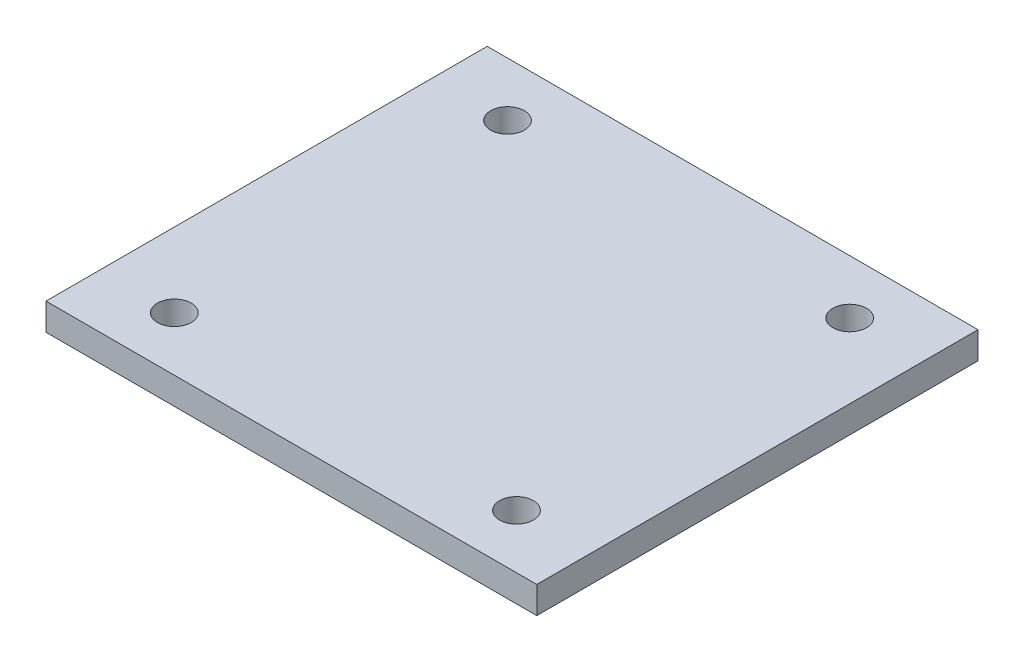
ISO-10303-21;
HEADER;
FILE_DESCRIPTION(('STEP AP214'),'2;1');
FILE_NAME('part.step','',(''),(''),'','','');
FILE_SCHEMA(('AUTOMOTIVE_DESIGN { 1 0 10303 214 1 1 1 1 }'));
ENDSEC;
DATA;
#1=APPLICATION_CONTEXT('core data for automotive mechanical design processes');
#2=APPLICATION_PROTOCOL_DEFINITION('international standard','automotive_design',2000,#1);
#3=PRODUCT_CONTEXT('',#1,'mechanical');
#4=PRODUCT('Part','Part','',(#3));
#5=PRODUCT_RELATED_PRODUCT_CATEGORY('part','',(#4));
#6=PRODUCT_DEFINITION_FORMATION('','',#4);
#7=PRODUCT_DEFINITION_CONTEXT('part definition',#1,'design');
#8=PRODUCT_DEFINITION('design','',#6,#7);
#9=PRODUCT_DEFINITION_SHAPE('','',#8);
#10=(LENGTH_UNIT() NAMED_UNIT(*) SI_UNIT(.MILLI.,.METRE.));
#11=(NAMED_UNIT(*) PLANE_ANGLE_UNIT() SI_UNIT($,.RADIAN.));
#12=(NAMED_UNIT(*) SI_UNIT($,.STERADIAN.) SOLID_ANGLE_UNIT());
#13=UNCERTAINTY_MEASURE_WITH_UNIT(LENGTH_MEASURE(1.E-05),#10,'distance_accuracy_value','');
#14=(GEOMETRIC_REPRESENTATION_CONTEXT(3) GLOBAL_UNCERTAINTY_ASSIGNED_CONTEXT((#13)) GLOBAL_UNIT_ASSIGNED_CONTEXT((#10,
#11,#12)) REPRESENTATION_CONTEXT('',''));
#15=CARTESIAN_POINT('',(0.,0.,0.));
#16=DIRECTION('',(0.,0.,1.));
#17=DIRECTION('',(1.,0.,0.));
#18=AXIS2_PLACEMENT_3D('',#15,#16,#17);
#19=CARTESIAN_POINT('',(0.,6.,0.));
#20=DIRECTION('',(0.,-1.,0.));
#21=DIRECTION('',(0.,0.,-1.));
#22=AXIS2_PLACEMENT_3D('',#19,#20,#21);
#23=PLANE('',#22);
#24=DIRECTION('',(0.,0.,1.));
#25=VECTOR('',#24,1.);
#26=CARTESIAN_POINT('',(0.,6.,0.));
#27=LINE('',#26,#25);
#28=CARTESIAN_POINT('',(0.,6.,-98.));
#29=VERTEX_POINT('',#28);
#30=CARTESIAN_POINT('',(0.,6.,0.));
#31=VERTEX_POINT('',#30);
#32=EDGE_CURVE('E85',#29,#31,#27,.T.);
#33=ORIENTED_EDGE('',*,*,#32,.T.);
#34=DIRECTION('',(1.,0.,0.));
#35=VECTOR('',#34,1.);
#36=CARTESIAN_POINT('',(0.,6.,0.));
#37=LINE('',#36,#35);
#38=CARTESIAN_POINT('',(109.,6.,0.));
#39=VERTEX_POINT('',#38);
#40=EDGE_CURVE('E80',#31,#39,#37,.T.);
#41=ORIENTED_EDGE('',*,*,#40,.T.);
#42=DIRECTION('',(0.,0.,-1.));
#43=VECTOR('',#42,1.);
#44=CARTESIAN_POINT('',(109.,6.,0.));
#45=LINE('',#44,#43);
#46=CARTESIAN_POINT('',(109.,6.,-98.));
#47=VERTEX_POINT('',#46);
#48=EDGE_CURVE('E83',#39,#47,#45,.T.);
#49=ORIENTED_EDGE('',*,*,#48,.T.);
#50=DIRECTION('',(-1.,0.,0.));
#51=VECTOR('',#50,1.);
#52=CARTESIAN_POINT('',(0.,6.,-98.));
#53=LINE('',#52,#51);
#54=EDGE_CURVE('E50',#47,#29,#53,.T.);
#55=ORIENTED_EDGE('',*,*,#54,.T.);
#56=EDGE_LOOP('',(#33,#41,#49,#55));
#57=FACE_BOUND('',#56,.T.);
#58=CARTESIAN_POINT('',(16.5,6.,-86.));
#59=DIRECTION('',(0.,1.,0.));
#60=DIRECTION('',(0.,0.,1.));
#61=AXIS2_PLACEMENT_3D('',#58,#59,#60);
#62=CIRCLE('',#61,3.75);
#63=CARTESIAN_POINT('',(16.5,6.,-82.25));
#64=VERTEX_POINT('',#63);
#65=EDGE_CURVE('E100',#64,#64,#62,.T.);
#66=ORIENTED_EDGE('',*,*,#65,.F.);
#67=EDGE_LOOP('',(#66));
#68=FACE_BOUND('',#67,.T.);
#69=CARTESIAN_POINT('',(92.5,6.,-86.));
#70=DIRECTION('',(0.,1.,0.));
#71=DIRECTION('',(0.,0.,1.));
#72=AXIS2_PLACEMENT_3D('',#69,#70,#71);
#73=CIRCLE('',#72,3.74999999999998);
#74=CARTESIAN_POINT('',(92.5,6.,-82.25));
#75=VERTEX_POINT('',#74);
#76=EDGE_CURVE('E115',#75,#75,#73,.T.);
#77=ORIENTED_EDGE('',*,*,#76,.F.);
#78=EDGE_LOOP('',(#77));
#79=FACE_BOUND('',#78,.T.);
#80=CARTESIAN_POINT('',(92.4999999999999,6.,-12.));
#81=DIRECTION('',(0.,1.,0.));
#82=DIRECTION('',(0.,0.,-1.));
#83=AXIS2_PLACEMENT_3D('',#80,#81,#82);
#84=CIRCLE('',#83,3.74999999999998);
#85=CARTESIAN_POINT('',(92.4999999999999,6.,-15.75));
#86=VERTEX_POINT('',#85);
#87=EDGE_CURVE('E121',#86,#86,#84,.T.);
#88=ORIENTED_EDGE('',*,*,#87,.F.);
#89=EDGE_LOOP('',(#88));
#90=FACE_BOUND('',#89,.T.);
#91=CARTESIAN_POINT('',(16.5,6.,-12.));
#92=DIRECTION('',(0.,1.,0.));
#93=DIRECTION('',(0.,0.,-1.));
#94=AXIS2_PLACEMENT_3D('',#91,#92,#93);
#95=CIRCLE('',#94,3.75);
#96=CARTESIAN_POINT('',(16.5,6.,-15.75));
#97=VERTEX_POINT('',#96);
#98=EDGE_CURVE('E127',#97,#97,#95,.T.);
#99=ORIENTED_EDGE('',*,*,#98,.F.);
#100=EDGE_LOOP('',(#99));
#101=FACE_BOUND('',#100,.T.);
#102=ADVANCED_FACE('F33',(#57,#68,#79,#90,#101),#23,.F.);
#103=CARTESIAN_POINT('',(0.,0.,0.));
#104=DIRECTION('',(0.,-1.,0.));
#105=DIRECTION('',(0.,0.,-1.));
#106=AXIS2_PLACEMENT_3D('',#103,#104,#105);
#107=PLANE('',#106);
#108=CARTESIAN_POINT('',(92.4999999999999,0.,-12.));
#109=DIRECTION('',(0.,1.,0.));
#110=DIRECTION('',(0.,0.,-1.));
#111=AXIS2_PLACEMENT_3D('',#108,#109,#110);
#112=CIRCLE('',#111,3.74999999999998);
#113=CARTESIAN_POINT('',(92.4999999999999,0.,-15.75));
#114=VERTEX_POINT('',#113);
#115=EDGE_CURVE('E124',#114,#114,#112,.T.);
#116=ORIENTED_EDGE('',*,*,#115,.T.);
#117=EDGE_LOOP('',(#116));
#118=FACE_BOUND('',#117,.T.);
#119=CARTESIAN_POINT('',(16.5,0.,-86.));
#120=DIRECTION('',(0.,1.,0.));
#121=DIRECTION('',(0.,0.,1.));
#122=AXIS2_PLACEMENT_3D('',#119,#120,#121);
#123=CIRCLE('',#122,3.75);
#124=CARTESIAN_POINT('',(16.5,0.,-82.25));
#125=VERTEX_POINT('',#124);
#126=EDGE_CURVE('E112',#125,#125,#123,.T.);
#127=ORIENTED_EDGE('',*,*,#126,.T.);
#128=EDGE_LOOP('',(#127));
#129=FACE_BOUND('',#128,.T.);
#130=DIRECTION('',(0.,0.,1.));
#131=VECTOR('',#130,1.);
#132=CARTESIAN_POINT('',(0.,0.,0.));
#133=LINE('',#132,#131);
#134=CARTESIAN_POINT('',(0.,0.,-98.));
#135=VERTEX_POINT('',#134);
#136=CARTESIAN_POINT('',(0.,0.,0.));
#137=VERTEX_POINT('',#136);
#138=EDGE_CURVE('E97',#135,#137,#133,.T.);
#139=ORIENTED_EDGE('',*,*,#138,.F.);
#140=DIRECTION('',(-1.,0.,0.));
#141=VECTOR('',#140,1.);
#142=CARTESIAN_POINT('',(0.,0.,-98.));
#143=LINE('',#142,#141);
#144=CARTESIAN_POINT('',(109.,0.,-98.));
#145=VERTEX_POINT('',#144);
#146=EDGE_CURVE('E73',#145,#135,#143,.T.);
#147=ORIENTED_EDGE('',*,*,#146,.F.);
#148=DIRECTION('',(0.,0.,-1.));
#149=VECTOR('',#148,1.);
#150=CARTESIAN_POINT('',(109.,0.,0.));
#151=LINE('',#150,#149);
#152=CARTESIAN_POINT('',(109.,0.,0.));
#153=VERTEX_POINT('',#152);
#154=EDGE_CURVE('E67',#153,#145,#151,.T.);
#155=ORIENTED_EDGE('',*,*,#154,.F.);
#156=DIRECTION('',(1.,0.,0.));
#157=VECTOR('',#156,1.);
#158=CARTESIAN_POINT('',(0.,0.,0.));
#159=LINE('',#158,#157);
#160=EDGE_CURVE('E89',#137,#153,#159,.T.);
#161=ORIENTED_EDGE('',*,*,#160,.F.);
#162=EDGE_LOOP('',(#139,#147,#155,#161));
#163=FACE_BOUND('',#162,.T.);
#164=CARTESIAN_POINT('',(92.5,0.,-86.));
#165=DIRECTION('',(0.,1.,0.));
#166=DIRECTION('',(0.,0.,1.));
#167=AXIS2_PLACEMENT_3D('',#164,#165,#166);
#168=CIRCLE('',#167,3.74999999999998);
#169=CARTESIAN_POINT('',(92.5,0.,-82.25));
#170=VERTEX_POINT('',#169);
#171=EDGE_CURVE('E118',#170,#170,#168,.T.);
#172=ORIENTED_EDGE('',*,*,#171,.T.);
#173=EDGE_LOOP('',(#172));
#174=FACE_BOUND('',#173,.T.);
#175=CARTESIAN_POINT('',(16.5,0.,-12.));
#176=DIRECTION('',(0.,1.,0.));
#177=DIRECTION('',(0.,0.,-1.));
#178=AXIS2_PLACEMENT_3D('',#175,#176,#177);
#179=CIRCLE('',#178,3.75);
#180=CARTESIAN_POINT('',(16.5,0.,-15.75));
#181=VERTEX_POINT('',#180);
#182=EDGE_CURVE('E130',#181,#181,#179,.T.);
#183=ORIENTED_EDGE('',*,*,#182,.T.);
#184=EDGE_LOOP('',(#183));
#185=FACE_BOUND('',#184,.T.);
#186=ADVANCED_FACE('F108',(#118,#129,#163,#174,#185),#107,.T.);
#187=CARTESIAN_POINT('',(0.,6.,0.));
#188=DIRECTION('',(1.,0.,0.));
#189=DIRECTION('',(0.,0.,-1.));
#190=AXIS2_PLACEMENT_3D('',#187,#188,#189);
#191=PLANE('',#190);
#192=ORIENTED_EDGE('',*,*,#138,.T.);
#193=DIRECTION('',(0.,-1.,0.));
#194=VECTOR('',#193,1.);
#195=CARTESIAN_POINT('',(0.,6.,0.));
#196=LINE('',#195,#194);
#197=EDGE_CURVE('E11',#31,#137,#196,.T.);
#198=ORIENTED_EDGE('',*,*,#197,.F.);
#199=ORIENTED_EDGE('',*,*,#32,.F.);
#200=DIRECTION('',(0.,-1.,0.));
#201=VECTOR('',#200,1.);
#202=CARTESIAN_POINT('',(0.,6.,-98.));
#203=LINE('',#202,#201);
#204=EDGE_CURVE('E93',#29,#135,#203,.T.);
#205=ORIENTED_EDGE('',*,*,#204,.T.);
#206=EDGE_LOOP('',(#192,#198,#199,#205));
#207=FACE_BOUND('',#206,.T.);
#208=ADVANCED_FACE('F35',(#207),#191,.F.);
#209=CARTESIAN_POINT('',(0.,6.,0.));
#210=DIRECTION('',(0.,0.,-1.));
#211=DIRECTION('',(-1.,0.,0.));
#212=AXIS2_PLACEMENT_3D('',#209,#210,#211);
#213=PLANE('',#212);
#214=ORIENTED_EDGE('',*,*,#160,.T.);
#215=DIRECTION('',(0.,-1.,0.));
#216=VECTOR('',#215,1.);
#217=CARTESIAN_POINT('',(109.,6.,0.));
#218=LINE('',#217,#216);
#219=EDGE_CURVE('E42',#39,#153,#218,.T.);
#220=ORIENTED_EDGE('',*,*,#219,.F.);
#221=ORIENTED_EDGE('',*,*,#40,.F.);
#222=ORIENTED_EDGE('',*,*,#197,.T.);
#223=EDGE_LOOP('',(#214,#220,#221,#222));
#224=FACE_BOUND('',#223,.T.);
#225=ADVANCED_FACE('F88',(#224),#213,.F.);
#226=CARTESIAN_POINT('',(109.,6.,0.));
#227=DIRECTION('',(-1.,0.,0.));
#228=DIRECTION('',(0.,0.,1.));
#229=AXIS2_PLACEMENT_3D('',#226,#227,#228);
#230=PLANE('',#229);
#231=ORIENTED_EDGE('',*,*,#154,.T.);
#232=DIRECTION('',(0.,-1.,0.));
#233=VECTOR('',#232,1.);
#234=CARTESIAN_POINT('',(109.,6.,-98.));
#235=LINE('',#234,#233);
#236=EDGE_CURVE('E90',#47,#145,#235,.T.);
#237=ORIENTED_EDGE('',*,*,#236,.F.);
#238=ORIENTED_EDGE('',*,*,#48,.F.);
#239=ORIENTED_EDGE('',*,*,#219,.T.);
#240=EDGE_LOOP('',(#231,#237,#238,#239));
#241=FACE_BOUND('',#240,.T.);
#242=ADVANCED_FACE('F91',(#241),#230,.F.);
#243=CARTESIAN_POINT('',(0.,6.,-98.));
#244=DIRECTION('',(0.,0.,1.));
#245=DIRECTION('',(1.,0.,0.));
#246=AXIS2_PLACEMENT_3D('',#243,#244,#245);
#247=PLANE('',#246);
#248=ORIENTED_EDGE('',*,*,#146,.T.);
#249=ORIENTED_EDGE('',*,*,#204,.F.);
#250=ORIENTED_EDGE('',*,*,#54,.F.);
#251=ORIENTED_EDGE('',*,*,#236,.T.);
#252=EDGE_LOOP('',(#248,#249,#250,#251));
#253=FACE_BOUND('',#252,.T.);
#254=ADVANCED_FACE('F105',(#253),#247,.F.);
#255=CARTESIAN_POINT('',(16.5,6.,-86.));
#256=DIRECTION('',(0.,-1.,0.));
#257=DIRECTION('',(0.,0.,-1.));
#258=AXIS2_PLACEMENT_3D('',#255,#256,#257);
#259=CYLINDRICAL_SURFACE('',#258,3.75);
#260=ORIENTED_EDGE('',*,*,#65,.T.);
#261=EDGE_LOOP('',(#260));
#262=FACE_BOUND('',#261,.T.);
#263=ORIENTED_EDGE('',*,*,#126,.F.);
#264=EDGE_LOOP('',(#263));
#265=FACE_BOUND('',#264,.T.);
#266=ADVANCED_FACE('F147',(#262,#265),#259,.F.);
#267=CARTESIAN_POINT('',(92.5,6.,-86.));
#268=DIRECTION('',(0.,-1.,0.));
#269=DIRECTION('',(0.,0.,-1.));
#270=AXIS2_PLACEMENT_3D('',#267,#268,#269);
#271=CYLINDRICAL_SURFACE('',#270,3.74999999999998);
#272=ORIENTED_EDGE('',*,*,#76,.T.);
#273=EDGE_LOOP('',(#272));
#274=FACE_BOUND('',#273,.T.);
#275=ORIENTED_EDGE('',*,*,#171,.F.);
#276=EDGE_LOOP('',(#275));
#277=FACE_BOUND('',#276,.T.);
#278=ADVANCED_FACE('F193',(#274,#277),#271,.F.);
#279=CARTESIAN_POINT('',(92.4999999999999,6.,-12.));
#280=DIRECTION('',(0.,-1.,0.));
#281=DIRECTION('',(0.,0.,-1.));
#282=AXIS2_PLACEMENT_3D('',#279,#280,#281);
#283=CYLINDRICAL_SURFACE('',#282,3.74999999999998);
#284=ORIENTED_EDGE('',*,*,#87,.T.);
#285=EDGE_LOOP('',(#284));
#286=FACE_BOUND('',#285,.T.);
#287=ORIENTED_EDGE('',*,*,#115,.F.);
#288=EDGE_LOOP('',(#287));
#289=FACE_BOUND('',#288,.T.);
#290=ADVANCED_FACE('F201',(#286,#289),#283,.F.);
#291=CARTESIAN_POINT('',(16.5,6.,-12.));
#292=DIRECTION('',(0.,-1.,0.));
#293=DIRECTION('',(0.,0.,-1.));
#294=AXIS2_PLACEMENT_3D('',#291,#292,#293);
#295=CYLINDRICAL_SURFACE('',#294,3.75);
#296=ORIENTED_EDGE('',*,*,#98,.T.);
#297=EDGE_LOOP('',(#296));
#298=FACE_BOUND('',#297,.T.);
#299=ORIENTED_EDGE('',*,*,#182,.F.);
#300=EDGE_LOOP('',(#299));
#301=FACE_BOUND('',#300,.T.);
#302=ADVANCED_FACE('F136',(#298,#301),#295,.F.);
#303=CLOSED_SHELL('',(#102,#186,#208,#225,#242,#254,#266,#278,#290,#302));
#304=MANIFOLD_SOLID_BREP('B2',#303);
#305=ADVANCED_BREP_SHAPE_REPRESENTATION('',(#18,#304),#14);
#306=SHAPE_DEFINITION_REPRESENTATION(#9,#305);
ENDSEC;
END-ISO-10303-21;
